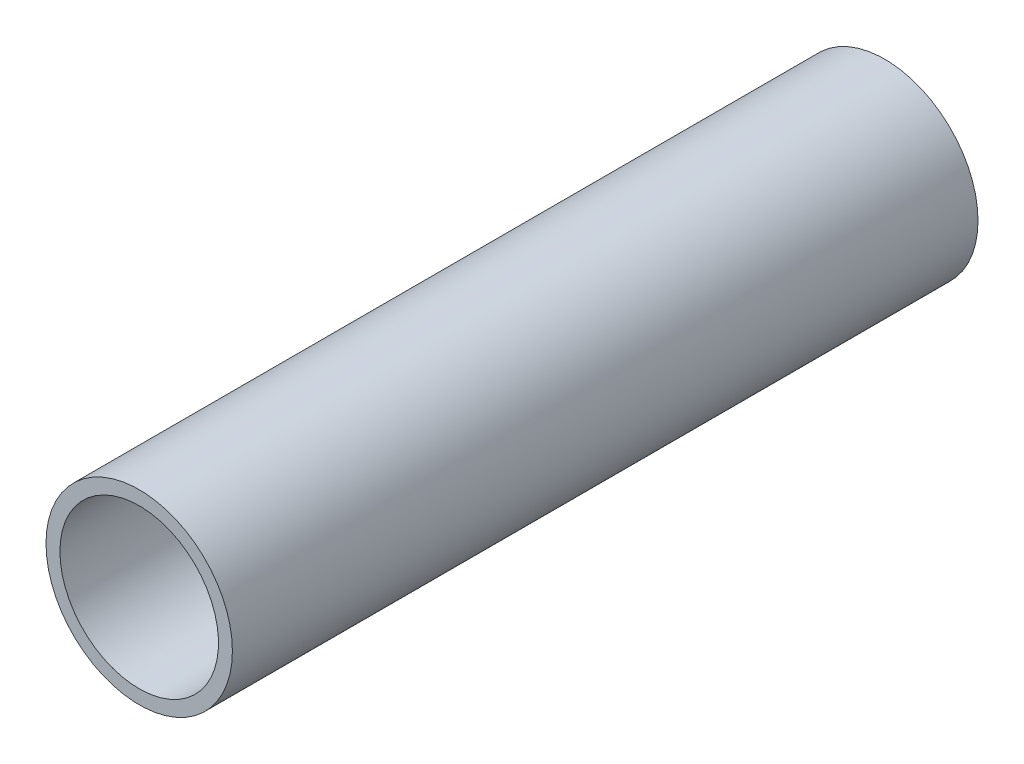
ISO-10303-21;
HEADER;
FILE_DESCRIPTION(('STEP AP214'),'2;1');
FILE_NAME('part.step','',(''),(''),'','','');
FILE_SCHEMA(('AUTOMOTIVE_DESIGN { 1 0 10303 214 1 1 1 1 }'));
ENDSEC;
DATA;
#1=APPLICATION_CONTEXT('core data for automotive mechanical design processes');
#2=APPLICATION_PROTOCOL_DEFINITION('international standard','automotive_design',2000,#1);
#3=PRODUCT_CONTEXT('',#1,'mechanical');
#4=PRODUCT('Part','Part','',(#3));
#5=PRODUCT_RELATED_PRODUCT_CATEGORY('part','',(#4));
#6=PRODUCT_DEFINITION_FORMATION('','',#4);
#7=PRODUCT_DEFINITION_CONTEXT('part definition',#1,'design');
#8=PRODUCT_DEFINITION('design','',#6,#7);
#9=PRODUCT_DEFINITION_SHAPE('','',#8);
#10=(LENGTH_UNIT() NAMED_UNIT(*) SI_UNIT(.MILLI.,.METRE.));
#11=(NAMED_UNIT(*) PLANE_ANGLE_UNIT() SI_UNIT($,.RADIAN.));
#12=(NAMED_UNIT(*) SI_UNIT($,.STERADIAN.) SOLID_ANGLE_UNIT());
#13=UNCERTAINTY_MEASURE_WITH_UNIT(LENGTH_MEASURE(1.E-05),#10,'distance_accuracy_value','');
#14=(GEOMETRIC_REPRESENTATION_CONTEXT(3) GLOBAL_UNCERTAINTY_ASSIGNED_CONTEXT((#13)) GLOBAL_UNIT_ASSIGNED_CONTEXT((#10,
#11,#12)) REPRESENTATION_CONTEXT('',''));
#15=CARTESIAN_POINT('',(0.,0.,0.));
#16=DIRECTION('',(0.,0.,1.));
#17=DIRECTION('',(1.,0.,0.));
#18=AXIS2_PLACEMENT_3D('',#15,#16,#17);
#19=CARTESIAN_POINT('',(0.,0.,19.05));
#20=DIRECTION('',(0.,0.,1.));
#21=DIRECTION('',(1.,0.,0.));
#22=AXIS2_PLACEMENT_3D('',#19,#20,#21);
#23=PLANE('',#22);
#24=CARTESIAN_POINT('',(0.,0.,19.05));
#25=DIRECTION('',(0.,0.,1.));
#26=DIRECTION('',(1.,0.,0.));
#27=AXIS2_PLACEMENT_3D('',#24,#25,#26);
#28=CIRCLE('',#27,4.7625);
#29=CARTESIAN_POINT('',(-4.7625,0.,19.05));
#30=VERTEX_POINT('',#29);
#31=EDGE_CURVE('E10',#30,#30,#28,.T.);
#32=ORIENTED_EDGE('',*,*,#31,.T.);
#33=EDGE_LOOP('',(#32));
#34=FACE_BOUND('',#33,.T.);
#35=CARTESIAN_POINT('',(0.,0.,19.05));
#36=DIRECTION('',(0.,0.,1.));
#37=DIRECTION('',(1.,0.,0.));
#38=AXIS2_PLACEMENT_3D('',#35,#36,#37);
#39=CIRCLE('',#38,4.0513);
#40=CARTESIAN_POINT('',(-4.0513,0.,19.05));
#41=VERTEX_POINT('',#40);
#42=EDGE_CURVE('E53',#41,#41,#39,.T.);
#43=ORIENTED_EDGE('',*,*,#42,.F.);
#44=EDGE_LOOP('',(#43));
#45=FACE_BOUND('',#44,.T.);
#46=ADVANCED_FACE('F40',(#34,#45),#23,.T.);
#47=CARTESIAN_POINT('',(0.,0.,-19.05));
#48=DIRECTION('',(0.,0.,1.));
#49=DIRECTION('',(1.,0.,0.));
#50=AXIS2_PLACEMENT_3D('',#47,#48,#49);
#51=PLANE('',#50);
#52=CARTESIAN_POINT('',(0.,0.,-19.05));
#53=DIRECTION('',(0.,0.,1.));
#54=DIRECTION('',(1.,0.,0.));
#55=AXIS2_PLACEMENT_3D('',#52,#53,#54);
#56=CIRCLE('',#55,4.7625);
#57=CARTESIAN_POINT('',(-4.7625,0.,-19.05));
#58=VERTEX_POINT('',#57);
#59=EDGE_CURVE('E44',#58,#58,#56,.T.);
#60=ORIENTED_EDGE('',*,*,#59,.F.);
#61=EDGE_LOOP('',(#60));
#62=FACE_BOUND('',#61,.T.);
#63=CARTESIAN_POINT('',(0.,0.,-19.05));
#64=DIRECTION('',(0.,0.,1.));
#65=DIRECTION('',(1.,0.,0.));
#66=AXIS2_PLACEMENT_3D('',#63,#64,#65);
#67=CIRCLE('',#66,4.0513);
#68=CARTESIAN_POINT('',(-4.0513,0.,-19.05));
#69=VERTEX_POINT('',#68);
#70=EDGE_CURVE('E55',#69,#69,#67,.T.);
#71=ORIENTED_EDGE('',*,*,#70,.T.);
#72=EDGE_LOOP('',(#71));
#73=FACE_BOUND('',#72,.T.);
#74=ADVANCED_FACE('F67',(#62,#73),#51,.F.);
#75=CARTESIAN_POINT('',(0.,0.,19.05));
#76=DIRECTION('',(0.,0.,-1.));
#77=DIRECTION('',(-1.,0.,0.));
#78=AXIS2_PLACEMENT_3D('',#75,#76,#77);
#79=CYLINDRICAL_SURFACE('',#78,4.7625);
#80=CARTESIAN_POINT('',(-4.7625,0.,19.05));
#81=CARTESIAN_POINT('',(-4.7625,0.,18.653125));
#82=CARTESIAN_POINT('',(-4.7625,0.,18.25625));
#83=CARTESIAN_POINT('',(-4.7625,0.,17.4625));
#84=CARTESIAN_POINT('',(-4.7625,0.,17.065625));
#85=CARTESIAN_POINT('',(-4.7625,0.,16.271875));
#86=CARTESIAN_POINT('',(-4.7625,0.,15.875));
#87=CARTESIAN_POINT('',(-4.7625,0.,15.08125));
#88=CARTESIAN_POINT('',(-4.7625,0.,14.684375));
#89=CARTESIAN_POINT('',(-4.7625,0.,13.890625));
#90=CARTESIAN_POINT('',(-4.7625,0.,13.49375));
#91=CARTESIAN_POINT('',(-4.7625,0.,12.7));
#92=CARTESIAN_POINT('',(-4.7625,0.,12.303125));
#93=CARTESIAN_POINT('',(-4.7625,0.,11.509375));
#94=CARTESIAN_POINT('',(-4.7625,0.,11.1125));
#95=CARTESIAN_POINT('',(-4.7625,0.,10.31875));
#96=CARTESIAN_POINT('',(-4.7625,0.,9.921875));
#97=CARTESIAN_POINT('',(-4.7625,0.,9.128125));
#98=CARTESIAN_POINT('',(-4.7625,0.,8.73125));
#99=CARTESIAN_POINT('',(-4.7625,0.,7.9375));
#100=CARTESIAN_POINT('',(-4.7625,0.,7.540625));
#101=CARTESIAN_POINT('',(-4.7625,0.,6.746875));
#102=CARTESIAN_POINT('',(-4.7625,0.,6.35));
#103=CARTESIAN_POINT('',(-4.7625,0.,5.55625));
#104=CARTESIAN_POINT('',(-4.7625,0.,5.159375));
#105=CARTESIAN_POINT('',(-4.7625,0.,4.365625));
#106=CARTESIAN_POINT('',(-4.7625,0.,3.96875));
#107=CARTESIAN_POINT('',(-4.7625,0.,3.175));
#108=CARTESIAN_POINT('',(-4.7625,0.,2.778125));
#109=CARTESIAN_POINT('',(-4.7625,0.,1.984375));
#110=CARTESIAN_POINT('',(-4.7625,0.,1.5875));
#111=CARTESIAN_POINT('',(-4.7625,0.,0.79375));
#112=CARTESIAN_POINT('',(-4.7625,0.,0.396875));
#113=CARTESIAN_POINT('',(-4.7625,0.,-0.396875));
#114=CARTESIAN_POINT('',(-4.7625,0.,-0.79375));
#115=CARTESIAN_POINT('',(-4.7625,0.,-1.5875));
#116=CARTESIAN_POINT('',(-4.7625,0.,-1.984375));
#117=CARTESIAN_POINT('',(-4.7625,0.,-2.778125));
#118=CARTESIAN_POINT('',(-4.7625,0.,-3.175));
#119=CARTESIAN_POINT('',(-4.7625,0.,-3.96875));
#120=CARTESIAN_POINT('',(-4.7625,0.,-4.365625));
#121=CARTESIAN_POINT('',(-4.7625,0.,-5.159375));
#122=CARTESIAN_POINT('',(-4.7625,0.,-5.55625));
#123=CARTESIAN_POINT('',(-4.7625,0.,-6.35));
#124=CARTESIAN_POINT('',(-4.7625,0.,-6.746875));
#125=CARTESIAN_POINT('',(-4.7625,0.,-7.540625));
#126=CARTESIAN_POINT('',(-4.7625,0.,-7.9375));
#127=CARTESIAN_POINT('',(-4.7625,0.,-8.73125));
#128=CARTESIAN_POINT('',(-4.7625,0.,-9.128125));
#129=CARTESIAN_POINT('',(-4.7625,0.,-9.921875));
#130=CARTESIAN_POINT('',(-4.7625,0.,-10.31875));
#131=CARTESIAN_POINT('',(-4.7625,0.,-11.1125));
#132=CARTESIAN_POINT('',(-4.7625,0.,-11.509375));
#133=CARTESIAN_POINT('',(-4.7625,0.,-12.303125));
#134=CARTESIAN_POINT('',(-4.7625,0.,-12.7));
#135=CARTESIAN_POINT('',(-4.7625,0.,-13.49375));
#136=CARTESIAN_POINT('',(-4.7625,0.,-13.890625));
#137=CARTESIAN_POINT('',(-4.7625,0.,-14.684375));
#138=CARTESIAN_POINT('',(-4.7625,0.,-15.08125));
#139=CARTESIAN_POINT('',(-4.7625,0.,-15.875));
#140=CARTESIAN_POINT('',(-4.7625,0.,-16.271875));
#141=CARTESIAN_POINT('',(-4.7625,0.,-17.065625));
#142=CARTESIAN_POINT('',(-4.7625,0.,-17.4625));
#143=CARTESIAN_POINT('',(-4.7625,0.,-18.25625));
#144=CARTESIAN_POINT('',(-4.7625,0.,-18.653125));
#145=CARTESIAN_POINT('',(-4.7625,0.,-19.05));
#146=B_SPLINE_CURVE_WITH_KNOTS('',3,(#80,#81,#82,#83,#84,#85,#86,#87,#88,#89,#90,#91,#92,#93,
#94,#95,#96,#97,#98,#99,#100,#101,#102,#103,#104,#105,#106,#107,#108,#109,#110,#111,#112,#113,
#114,#115,#116,#117,#118,#119,#120,#121,#122,#123,#124,#125,#126,#127,#128,#129,#130,#131,#132,
#133,#134,#135,#136,#137,#138,#139,#140,#141,#142,#143,#144,#145),.UNSPECIFIED.,.F.,.F.,(4,2,2,
2,2,2,2,2,2,2,2,2,2,2,2,2,2,2,2,2,2,2,2,2,2,2,2,2,2,2,2,2,4),(0.,1.190625,2.38125,3.571875,
4.7625,5.953125,7.14375,8.334375,9.525,10.715625,11.90625,13.096875,14.2875,15.478125,16.66875,
17.859375,19.05,20.240625,21.43125,22.621875,23.8125,25.003125,26.19375,27.384375,28.575,
29.765625,30.95625,32.146875,33.3375,34.528125,35.71875,36.909375,38.1),.UNSPECIFIED.);
#147=EDGE_CURVE('BSEAM42',#30,#58,#146,.T.);
#148=ORIENTED_EDGE('',*,*,#31,.F.);
#149=ORIENTED_EDGE('',*,*,#59,.T.);
#150=ORIENTED_EDGE('',*,*,#147,.T.);
#151=ORIENTED_EDGE('',*,*,#147,.F.);
#152=EDGE_LOOP('',(#148,#150,#149,#151));
#153=FACE_BOUND('',#152,.T.);
#154=ADVANCED_FACE('F42',(#153),#79,.T.);
#155=CARTESIAN_POINT('',(0.,0.,19.05));
#156=DIRECTION('',(0.,0.,-1.));
#157=DIRECTION('',(-1.,0.,0.));
#158=AXIS2_PLACEMENT_3D('',#155,#156,#157);
#159=CYLINDRICAL_SURFACE('',#158,4.0513);
#160=CARTESIAN_POINT('',(-4.0513,0.,19.05));
#161=CARTESIAN_POINT('',(-4.0513,0.,18.653125));
#162=CARTESIAN_POINT('',(-4.0513,0.,18.25625));
#163=CARTESIAN_POINT('',(-4.0513,0.,17.4625));
#164=CARTESIAN_POINT('',(-4.0513,0.,17.065625));
#165=CARTESIAN_POINT('',(-4.0513,0.,16.271875));
#166=CARTESIAN_POINT('',(-4.0513,0.,15.875));
#167=CARTESIAN_POINT('',(-4.0513,0.,15.08125));
#168=CARTESIAN_POINT('',(-4.0513,0.,14.684375));
#169=CARTESIAN_POINT('',(-4.0513,0.,13.890625));
#170=CARTESIAN_POINT('',(-4.0513,0.,13.49375));
#171=CARTESIAN_POINT('',(-4.0513,0.,12.7));
#172=CARTESIAN_POINT('',(-4.0513,0.,12.303125));
#173=CARTESIAN_POINT('',(-4.0513,0.,11.509375));
#174=CARTESIAN_POINT('',(-4.0513,0.,11.1125));
#175=CARTESIAN_POINT('',(-4.0513,0.,10.31875));
#176=CARTESIAN_POINT('',(-4.0513,0.,9.921875));
#177=CARTESIAN_POINT('',(-4.0513,0.,9.128125));
#178=CARTESIAN_POINT('',(-4.0513,0.,8.73125));
#179=CARTESIAN_POINT('',(-4.0513,0.,7.9375));
#180=CARTESIAN_POINT('',(-4.0513,0.,7.540625));
#181=CARTESIAN_POINT('',(-4.0513,0.,6.746875));
#182=CARTESIAN_POINT('',(-4.0513,0.,6.35));
#183=CARTESIAN_POINT('',(-4.0513,0.,5.55625));
#184=CARTESIAN_POINT('',(-4.0513,0.,5.159375));
#185=CARTESIAN_POINT('',(-4.0513,0.,4.365625));
#186=CARTESIAN_POINT('',(-4.0513,0.,3.96875));
#187=CARTESIAN_POINT('',(-4.0513,0.,3.175));
#188=CARTESIAN_POINT('',(-4.0513,0.,2.778125));
#189=CARTESIAN_POINT('',(-4.0513,0.,1.984375));
#190=CARTESIAN_POINT('',(-4.0513,0.,1.5875));
#191=CARTESIAN_POINT('',(-4.0513,0.,0.793749999999997));
#192=CARTESIAN_POINT('',(-4.0513,0.,0.396874999999997));
#193=CARTESIAN_POINT('',(-4.0513,0.,-0.396875000000004));
#194=CARTESIAN_POINT('',(-4.0513,0.,-0.793750000000004));
#195=CARTESIAN_POINT('',(-4.0513,0.,-1.5875));
#196=CARTESIAN_POINT('',(-4.0513,0.,-1.984375));
#197=CARTESIAN_POINT('',(-4.0513,0.,-2.77812500000001));
#198=CARTESIAN_POINT('',(-4.0513,0.,-3.17500000000001));
#199=CARTESIAN_POINT('',(-4.0513,0.,-3.96875000000001));
#200=CARTESIAN_POINT('',(-4.0513,0.,-4.36562500000001));
#201=CARTESIAN_POINT('',(-4.0513,0.,-5.15937500000001));
#202=CARTESIAN_POINT('',(-4.0513,0.,-5.55625));
#203=CARTESIAN_POINT('',(-4.0513,0.,-6.35));
#204=CARTESIAN_POINT('',(-4.0513,0.,-6.746875));
#205=CARTESIAN_POINT('',(-4.0513,0.,-7.540625));
#206=CARTESIAN_POINT('',(-4.0513,0.,-7.93750000000001));
#207=CARTESIAN_POINT('',(-4.0513,0.,-8.73125));
#208=CARTESIAN_POINT('',(-4.0513,0.,-9.12812500000001));
#209=CARTESIAN_POINT('',(-4.0513,0.,-9.92187500000001));
#210=CARTESIAN_POINT('',(-4.0513,0.,-10.31875));
#211=CARTESIAN_POINT('',(-4.0513,0.,-11.1125));
#212=CARTESIAN_POINT('',(-4.0513,0.,-11.509375));
#213=CARTESIAN_POINT('',(-4.0513,0.,-12.303125));
#214=CARTESIAN_POINT('',(-4.0513,0.,-12.7));
#215=CARTESIAN_POINT('',(-4.0513,0.,-13.49375));
#216=CARTESIAN_POINT('',(-4.0513,0.,-13.890625));
#217=CARTESIAN_POINT('',(-4.0513,0.,-14.684375));
#218=CARTESIAN_POINT('',(-4.0513,0.,-15.08125));
#219=CARTESIAN_POINT('',(-4.0513,0.,-15.875));
#220=CARTESIAN_POINT('',(-4.0513,0.,-16.271875));
#221=CARTESIAN_POINT('',(-4.0513,0.,-17.065625));
#222=CARTESIAN_POINT('',(-4.0513,0.,-17.4625));
#223=CARTESIAN_POINT('',(-4.0513,0.,-18.25625));
#224=CARTESIAN_POINT('',(-4.0513,0.,-18.653125));
#225=CARTESIAN_POINT('',(-4.0513,0.,-19.05));
#226=B_SPLINE_CURVE_WITH_KNOTS('',3,(#160,#161,#162,#163,#164,#165,#166,#167,#168,#169,#170,
#171,#172,#173,#174,#175,#176,#177,#178,#179,#180,#181,#182,#183,#184,#185,#186,#187,#188,#189,
#190,#191,#192,#193,#194,#195,#196,#197,#198,#199,#200,#201,#202,#203,#204,#205,#206,#207,#208,
#209,#210,#211,#212,#213,#214,#215,#216,#217,#218,#219,#220,#221,#222,#223,#224,#225),
.UNSPECIFIED.,.F.,.F.,(4,2,2,2,2,2,2,2,2,2,2,2,2,2,2,2,2,2,2,2,2,2,2,2,2,2,2,2,2,2,2,2,4),(0.,
1.190625,2.38125,3.571875,4.7625,5.953125,7.14375,8.334375,9.525,10.715625,11.90625,13.096875,
14.2875,15.478125,16.66875,17.859375,19.05,20.240625,21.43125,22.621875,23.8125,25.003125,
26.19375,27.384375,28.575,29.765625,30.95625,32.146875,33.3375,34.528125,35.71875,36.909375,
38.1),.UNSPECIFIED.);
#227=EDGE_CURVE('BSEAM63',#41,#69,#226,.T.);
#228=ORIENTED_EDGE('',*,*,#42,.T.);
#229=ORIENTED_EDGE('',*,*,#70,.F.);
#230=ORIENTED_EDGE('',*,*,#227,.T.);
#231=ORIENTED_EDGE('',*,*,#227,.F.);
#232=EDGE_LOOP('',(#228,#230,#229,#231));
#233=FACE_BOUND('',#232,.T.);
#234=ADVANCED_FACE('F63',(#233),#159,.F.);
#235=CLOSED_SHELL('',(#46,#74,#154,#234));
#236=MANIFOLD_SOLID_BREP('B2',#235);
#237=ADVANCED_BREP_SHAPE_REPRESENTATION('',(#18,#236),#14);
#238=SHAPE_DEFINITION_REPRESENTATION(#9,#237);
ENDSEC;
END-ISO-10303-21;
